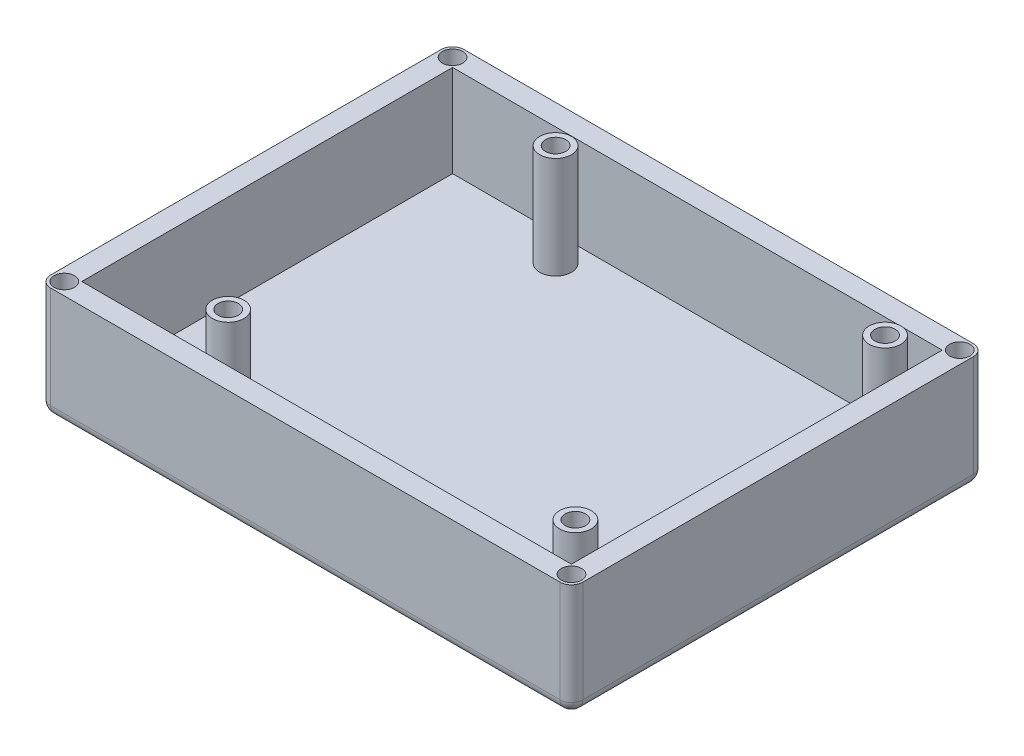
ISO-10303-21;
HEADER;
FILE_DESCRIPTION(('STEP AP214'),'2;1');
FILE_NAME('part.step','',(''),(''),'','','');
FILE_SCHEMA(('AUTOMOTIVE_DESIGN { 1 0 10303 214 1 1 1 1 }'));
ENDSEC;
DATA;
#1=APPLICATION_CONTEXT('core data for automotive mechanical design processes');
#2=APPLICATION_PROTOCOL_DEFINITION('international standard','automotive_design',2000,#1);
#3=PRODUCT_CONTEXT('',#1,'mechanical');
#4=PRODUCT('Part','Part','',(#3));
#5=PRODUCT_RELATED_PRODUCT_CATEGORY('part','',(#4));
#6=PRODUCT_DEFINITION_FORMATION('','',#4);
#7=PRODUCT_DEFINITION_CONTEXT('part definition',#1,'design');
#8=PRODUCT_DEFINITION('design','',#6,#7);
#9=PRODUCT_DEFINITION_SHAPE('','',#8);
#10=(LENGTH_UNIT() NAMED_UNIT(*) SI_UNIT(.MILLI.,.METRE.));
#11=(NAMED_UNIT(*) PLANE_ANGLE_UNIT() SI_UNIT($,.RADIAN.));
#12=(NAMED_UNIT(*) SI_UNIT($,.STERADIAN.) SOLID_ANGLE_UNIT());
#13=UNCERTAINTY_MEASURE_WITH_UNIT(LENGTH_MEASURE(1.E-05),#10,'distance_accuracy_value','');
#14=(GEOMETRIC_REPRESENTATION_CONTEXT(3) GLOBAL_UNCERTAINTY_ASSIGNED_CONTEXT((#13)) GLOBAL_UNIT_ASSIGNED_CONTEXT((#10,
#11,#12)) REPRESENTATION_CONTEXT('',''));
#15=CARTESIAN_POINT('',(0.,0.,0.));
#16=DIRECTION('',(0.,0.,1.));
#17=DIRECTION('',(1.,0.,0.));
#18=AXIS2_PLACEMENT_3D('',#15,#16,#17);
#19=CARTESIAN_POINT('',(-59.69,25.4,46.355));
#20=DIRECTION('',(1.,0.,0.));
#21=DIRECTION('',(0.,0.,-1.));
#22=AXIS2_PLACEMENT_3D('',#19,#20,#21);
#23=PLANE('',#22);
#24=DIRECTION('',(0.,-1.,0.));
#25=VECTOR('',#24,1.);
#26=CARTESIAN_POINT('',(-59.69,25.4,-43.815));
#27=LINE('',#26,#25);
#28=CARTESIAN_POINT('',(-59.69,25.4,-43.815));
#29=VERTEX_POINT('',#28);
#30=CARTESIAN_POINT('',(-59.69,2.54,-43.815));
#31=VERTEX_POINT('',#30);
#32=EDGE_CURVE('E239',#29,#31,#27,.T.);
#33=ORIENTED_EDGE('',*,*,#32,.T.);
#34=DIRECTION('',(0.,0.,-1.));
#35=VECTOR('',#34,1.);
#36=CARTESIAN_POINT('',(-59.69,2.54,46.355));
#37=LINE('',#36,#35);
#38=CARTESIAN_POINT('',(-59.69,2.54,43.815));
#39=VERTEX_POINT('',#38);
#40=EDGE_CURVE('E282',#31,#39,#37,.F.);
#41=ORIENTED_EDGE('',*,*,#40,.T.);
#42=DIRECTION('',(0.,-1.,0.));
#43=VECTOR('',#42,1.);
#44=CARTESIAN_POINT('',(-59.69,25.4,43.815));
#45=LINE('',#44,#43);
#46=CARTESIAN_POINT('',(-59.69,25.4,43.815));
#47=VERTEX_POINT('',#46);
#48=EDGE_CURVE('E236',#39,#47,#45,.F.);
#49=ORIENTED_EDGE('',*,*,#48,.T.);
#50=DIRECTION('',(0.,0.,-1.));
#51=VECTOR('',#50,1.);
#52=CARTESIAN_POINT('',(-59.69,25.4,46.355));
#53=LINE('',#52,#51);
#54=EDGE_CURVE('E200',#47,#29,#53,.T.);
#55=ORIENTED_EDGE('',*,*,#54,.T.);
#56=EDGE_LOOP('',(#33,#41,#49,#55));
#57=FACE_BOUND('',#56,.T.);
#58=ADVANCED_FACE('F45',(#57),#23,.F.);
#59=CARTESIAN_POINT('',(-59.69,0.,46.355));
#60=DIRECTION('',(0.,1.,0.));
#61=DIRECTION('',(0.,0.,1.));
#62=AXIS2_PLACEMENT_3D('',#59,#60,#61);
#63=PLANE('',#62);
#64=DIRECTION('',(0.,0.,-1.));
#65=VECTOR('',#64,1.);
#66=CARTESIAN_POINT('',(57.15,0.,46.355));
#67=LINE('',#66,#65);
#68=CARTESIAN_POINT('',(57.15,0.,-43.815));
#69=VERTEX_POINT('',#68);
#70=CARTESIAN_POINT('',(57.15,0.,43.815));
#71=VERTEX_POINT('',#70);
#72=EDGE_CURVE('E262',#69,#71,#67,.F.);
#73=ORIENTED_EDGE('',*,*,#72,.T.);
#74=DIRECTION('',(1.,0.,0.));
#75=VECTOR('',#74,1.);
#76=CARTESIAN_POINT('',(-57.15,0.,43.815));
#77=LINE('',#76,#75);
#78=CARTESIAN_POINT('',(-57.15,0.,43.815));
#79=VERTEX_POINT('',#78);
#80=EDGE_CURVE('E265',#71,#79,#77,.F.);
#81=ORIENTED_EDGE('',*,*,#80,.T.);
#82=DIRECTION('',(0.,0.,-1.));
#83=VECTOR('',#82,1.);
#84=CARTESIAN_POINT('',(-57.15,0.,46.355));
#85=LINE('',#84,#83);
#86=CARTESIAN_POINT('',(-57.15,0.,-43.815));
#87=VERTEX_POINT('',#86);
#88=EDGE_CURVE('E256',#79,#87,#85,.T.);
#89=ORIENTED_EDGE('',*,*,#88,.T.);
#90=DIRECTION('',(1.,0.,0.));
#91=VECTOR('',#90,1.);
#92=CARTESIAN_POINT('',(-59.69,0.,-43.815));
#93=LINE('',#92,#91);
#94=EDGE_CURVE('E259',#87,#69,#93,.T.);
#95=ORIENTED_EDGE('',*,*,#94,.T.);
#96=EDGE_LOOP('',(#73,#81,#89,#95));
#97=FACE_BOUND('',#96,.T.);
#98=ADVANCED_FACE('F357',(#97),#63,.F.);
#99=CARTESIAN_POINT('',(59.69,25.4,46.355));
#100=DIRECTION('',(-1.,0.,0.));
#101=DIRECTION('',(0.,-1.,0.));
#102=AXIS2_PLACEMENT_3D('',#99,#100,#101);
#103=PLANE('',#102);
#104=DIRECTION('',(0.,1.,0.));
#105=VECTOR('',#104,1.);
#106=CARTESIAN_POINT('',(59.69,0.,43.815));
#107=LINE('',#106,#105);
#108=CARTESIAN_POINT('',(59.69,25.4,43.815));
#109=VERTEX_POINT('',#108);
#110=CARTESIAN_POINT('',(59.69,2.54,43.815));
#111=VERTEX_POINT('',#110);
#112=EDGE_CURVE('E211',#109,#111,#107,.F.);
#113=ORIENTED_EDGE('',*,*,#112,.T.);
#114=DIRECTION('',(0.,0.,-1.));
#115=VECTOR('',#114,1.);
#116=CARTESIAN_POINT('',(59.69,2.54,46.355));
#117=LINE('',#116,#115);
#118=CARTESIAN_POINT('',(59.69,2.54,-43.815));
#119=VERTEX_POINT('',#118);
#120=EDGE_CURVE('E272',#111,#119,#117,.T.);
#121=ORIENTED_EDGE('',*,*,#120,.T.);
#122=DIRECTION('',(0.,1.,0.));
#123=VECTOR('',#122,1.);
#124=CARTESIAN_POINT('',(59.69,25.4,-43.815));
#125=LINE('',#124,#123);
#126=CARTESIAN_POINT('',(59.69,25.4,-43.815));
#127=VERTEX_POINT('',#126);
#128=EDGE_CURVE('E215',#119,#127,#125,.T.);
#129=ORIENTED_EDGE('',*,*,#128,.T.);
#130=DIRECTION('',(0.,0.,-1.));
#131=VECTOR('',#130,1.);
#132=CARTESIAN_POINT('',(59.69,25.4,46.355));
#133=LINE('',#132,#131);
#134=EDGE_CURVE('E207',#109,#127,#133,.T.);
#135=ORIENTED_EDGE('',*,*,#134,.F.);
#136=EDGE_LOOP('',(#113,#121,#129,#135));
#137=FACE_BOUND('',#136,.T.);
#138=ADVANCED_FACE('F363',(#137),#103,.F.);
#139=CARTESIAN_POINT('',(-59.69,25.4,46.355));
#140=DIRECTION('',(0.,-1.,0.));
#141=DIRECTION('',(1.,0.,0.));
#142=AXIS2_PLACEMENT_3D('',#139,#140,#141);
#143=PLANE('',#142);
#144=CARTESIAN_POINT('',(-56.896,25.4,-43.561));
#145=DIRECTION('',(0.,1.,0.));
#146=DIRECTION('',(-1.,0.,0.));
#147=AXIS2_PLACEMENT_3D('',#144,#145,#146);
#148=CIRCLE('',#147,2.28599999999999);
#149=CARTESIAN_POINT('',(-59.182,25.4,-43.561));
#150=VERTEX_POINT('',#149);
#151=EDGE_CURVE('E511',#150,#150,#148,.T.);
#152=ORIENTED_EDGE('',*,*,#151,.F.);
#153=EDGE_LOOP('',(#152));
#154=FACE_BOUND('',#153,.T.);
#155=CARTESIAN_POINT('',(56.896,25.4,43.561));
#156=DIRECTION('',(0.,1.,0.));
#157=DIRECTION('',(-1.,0.,0.));
#158=AXIS2_PLACEMENT_3D('',#155,#156,#157);
#159=CIRCLE('',#158,2.28599999999999);
#160=CARTESIAN_POINT('',(54.61,25.4,43.561));
#161=VERTEX_POINT('',#160);
#162=EDGE_CURVE('E503',#161,#161,#159,.T.);
#163=ORIENTED_EDGE('',*,*,#162,.F.);
#164=EDGE_LOOP('',(#163));
#165=FACE_BOUND('',#164,.T.);
#166=CARTESIAN_POINT('',(-56.896,25.4,43.561));
#167=DIRECTION('',(0.,1.,0.));
#168=DIRECTION('',(-1.,0.,0.));
#169=AXIS2_PLACEMENT_3D('',#166,#167,#168);
#170=CIRCLE('',#169,2.28599999999999);
#171=CARTESIAN_POINT('',(-59.182,25.4,43.561));
#172=VERTEX_POINT('',#171);
#173=EDGE_CURVE('E495',#172,#172,#170,.T.);
#174=ORIENTED_EDGE('',*,*,#173,.F.);
#175=EDGE_LOOP('',(#174));
#176=FACE_BOUND('',#175,.T.);
#177=CARTESIAN_POINT('',(56.896,25.4,-43.561));
#178=DIRECTION('',(0.,1.,0.));
#179=DIRECTION('',(-1.,0.,0.));
#180=AXIS2_PLACEMENT_3D('',#177,#178,#179);
#181=CIRCLE('',#180,2.286);
#182=CARTESIAN_POINT('',(54.61,25.4,-43.561));
#183=VERTEX_POINT('',#182);
#184=EDGE_CURVE('E482',#183,#183,#181,.T.);
#185=ORIENTED_EDGE('',*,*,#184,.F.);
#186=EDGE_LOOP('',(#185));
#187=FACE_BOUND('',#186,.T.);
#188=DIRECTION('',(-1.,0.,0.));
#189=VECTOR('',#188,1.);
#190=CARTESIAN_POINT('',(-54.9275,25.4,-41.5925));
#191=LINE('',#190,#189);
#192=CARTESIAN_POINT('',(54.9275,25.4,-41.5925));
#193=VERTEX_POINT('',#192);
#194=CARTESIAN_POINT('',(-54.9275,25.4,-41.5925));
#195=VERTEX_POINT('',#194);
#196=EDGE_CURVE('E166',#193,#195,#191,.T.);
#197=ORIENTED_EDGE('',*,*,#196,.F.);
#198=DIRECTION('',(0.,0.,-1.));
#199=VECTOR('',#198,1.);
#200=CARTESIAN_POINT('',(54.9275,25.4,41.5925));
#201=LINE('',#200,#199);
#202=CARTESIAN_POINT('',(54.9275,25.4,41.5925));
#203=VERTEX_POINT('',#202);
#204=EDGE_CURVE('E172',#203,#193,#201,.T.);
#205=ORIENTED_EDGE('',*,*,#204,.F.);
#206=DIRECTION('',(1.,0.,0.));
#207=VECTOR('',#206,1.);
#208=CARTESIAN_POINT('',(-54.9275,25.4,41.5925));
#209=LINE('',#208,#207);
#210=CARTESIAN_POINT('',(-54.9275,25.4,41.5925));
#211=VERTEX_POINT('',#210);
#212=EDGE_CURVE('E177',#211,#203,#209,.T.);
#213=ORIENTED_EDGE('',*,*,#212,.F.);
#214=DIRECTION('',(0.,0.,1.));
#215=VECTOR('',#214,1.);
#216=CARTESIAN_POINT('',(-54.9275,25.4,41.5925));
#217=LINE('',#216,#215);
#218=EDGE_CURVE('E154',#195,#211,#217,.T.);
#219=ORIENTED_EDGE('',*,*,#218,.F.);
#220=EDGE_LOOP('',(#197,#205,#213,#219));
#221=FACE_BOUND('',#220,.T.);
#222=ORIENTED_EDGE('',*,*,#134,.T.);
#223=CARTESIAN_POINT('',(57.15,25.4,-43.815));
#224=DIRECTION('',(0.,-1.,0.));
#225=DIRECTION('',(1.,0.,0.));
#226=AXIS2_PLACEMENT_3D('',#223,#224,#225);
#227=CIRCLE('',#226,2.54);
#228=CARTESIAN_POINT('',(57.15,25.4,-46.355));
#229=VERTEX_POINT('',#228);
#230=EDGE_CURVE('E227',#127,#229,#227,.F.);
#231=ORIENTED_EDGE('',*,*,#230,.T.);
#232=DIRECTION('',(-1.,0.,0.));
#233=VECTOR('',#232,1.);
#234=CARTESIAN_POINT('',(-59.69,25.4,-46.355));
#235=LINE('',#234,#233);
#236=CARTESIAN_POINT('',(-57.15,25.4,-46.355));
#237=VERTEX_POINT('',#236);
#238=EDGE_CURVE('E194',#229,#237,#235,.T.);
#239=ORIENTED_EDGE('',*,*,#238,.T.);
#240=CARTESIAN_POINT('',(-57.15,25.4,-43.815));
#241=DIRECTION('',(0.,-1.,0.));
#242=DIRECTION('',(1.,0.,0.));
#243=AXIS2_PLACEMENT_3D('',#240,#241,#242);
#244=CIRCLE('',#243,2.54);
#245=EDGE_CURVE('E224',#237,#29,#244,.F.);
#246=ORIENTED_EDGE('',*,*,#245,.T.);
#247=ORIENTED_EDGE('',*,*,#54,.F.);
#248=CARTESIAN_POINT('',(-57.15,25.4,43.815));
#249=DIRECTION('',(0.,-1.,0.));
#250=DIRECTION('',(1.,0.,0.));
#251=AXIS2_PLACEMENT_3D('',#248,#249,#250);
#252=CIRCLE('',#251,2.54);
#253=CARTESIAN_POINT('',(-57.15,25.4,46.355));
#254=VERTEX_POINT('',#253);
#255=EDGE_CURVE('E221',#47,#254,#252,.F.);
#256=ORIENTED_EDGE('',*,*,#255,.T.);
#257=DIRECTION('',(-1.,0.,0.));
#258=VECTOR('',#257,1.);
#259=CARTESIAN_POINT('',(-59.69,25.4,46.355));
#260=LINE('',#259,#258);
#261=CARTESIAN_POINT('',(57.15,25.4,46.355));
#262=VERTEX_POINT('',#261);
#263=EDGE_CURVE('E196',#262,#254,#260,.T.);
#264=ORIENTED_EDGE('',*,*,#263,.F.);
#265=CARTESIAN_POINT('',(57.15,25.4,43.815));
#266=DIRECTION('',(0.,-1.,0.));
#267=DIRECTION('',(1.,0.,0.));
#268=AXIS2_PLACEMENT_3D('',#265,#266,#267);
#269=CIRCLE('',#268,2.54);
#270=EDGE_CURVE('E218',#262,#109,#269,.F.);
#271=ORIENTED_EDGE('',*,*,#270,.T.);
#272=EDGE_LOOP('',(#222,#231,#239,#246,#247,#256,#264,#271));
#273=FACE_BOUND('',#272,.T.);
#274=ADVANCED_FACE('F174',(#154,#165,#176,#187,#221,#273),#143,.F.);
#275=CARTESIAN_POINT('',(0.,0.,46.355));
#276=DIRECTION('',(0.,0.,1.));
#277=DIRECTION('',(1.,0.,0.));
#278=AXIS2_PLACEMENT_3D('',#275,#276,#277);
#279=PLANE('',#278);
#280=DIRECTION('',(0.,-1.,0.));
#281=VECTOR('',#280,1.);
#282=CARTESIAN_POINT('',(-57.15,0.,46.355));
#283=LINE('',#282,#281);
#284=CARTESIAN_POINT('',(-57.15,2.54,46.355));
#285=VERTEX_POINT('',#284);
#286=EDGE_CURVE('E245',#254,#285,#283,.T.);
#287=ORIENTED_EDGE('',*,*,#286,.T.);
#288=DIRECTION('',(1.,0.,0.));
#289=VECTOR('',#288,1.);
#290=CARTESIAN_POINT('',(57.15,2.54,46.355));
#291=LINE('',#290,#289);
#292=CARTESIAN_POINT('',(57.15,2.54,46.355));
#293=VERTEX_POINT('',#292);
#294=EDGE_CURVE('E253',#285,#293,#291,.T.);
#295=ORIENTED_EDGE('',*,*,#294,.T.);
#296=DIRECTION('',(0.,1.,0.));
#297=VECTOR('',#296,1.);
#298=CARTESIAN_POINT('',(57.15,25.4,46.355));
#299=LINE('',#298,#297);
#300=EDGE_CURVE('E242',#293,#262,#299,.T.);
#301=ORIENTED_EDGE('',*,*,#300,.T.);
#302=ORIENTED_EDGE('',*,*,#263,.T.);
#303=EDGE_LOOP('',(#287,#295,#301,#302));
#304=FACE_BOUND('',#303,.T.);
#305=ADVANCED_FACE('F442',(#304),#279,.T.);
#306=CARTESIAN_POINT('',(0.,0.,-46.355));
#307=DIRECTION('',(0.,0.,1.));
#308=DIRECTION('',(1.,0.,0.));
#309=AXIS2_PLACEMENT_3D('',#306,#307,#308);
#310=PLANE('',#309);
#311=DIRECTION('',(0.,1.,0.));
#312=VECTOR('',#311,1.);
#313=CARTESIAN_POINT('',(57.15,0.,-46.355));
#314=LINE('',#313,#312);
#315=CARTESIAN_POINT('',(57.15,2.54,-46.355));
#316=VERTEX_POINT('',#315);
#317=EDGE_CURVE('E233',#229,#316,#314,.F.);
#318=ORIENTED_EDGE('',*,*,#317,.T.);
#319=DIRECTION('',(1.,0.,0.));
#320=VECTOR('',#319,1.);
#321=CARTESIAN_POINT('',(0.,2.54,-46.355));
#322=LINE('',#321,#320);
#323=CARTESIAN_POINT('',(-57.15,2.54,-46.355));
#324=VERTEX_POINT('',#323);
#325=EDGE_CURVE('E69',#316,#324,#322,.F.);
#326=ORIENTED_EDGE('',*,*,#325,.T.);
#327=DIRECTION('',(0.,-1.,0.));
#328=VECTOR('',#327,1.);
#329=CARTESIAN_POINT('',(-57.15,0.,-46.355));
#330=LINE('',#329,#328);
#331=EDGE_CURVE('E230',#324,#237,#330,.F.);
#332=ORIENTED_EDGE('',*,*,#331,.T.);
#333=ORIENTED_EDGE('',*,*,#238,.F.);
#334=EDGE_LOOP('',(#318,#326,#332,#333));
#335=FACE_BOUND('',#334,.T.);
#336=ADVANCED_FACE('F424',(#335),#310,.F.);
#337=CARTESIAN_POINT('',(54.9275,-137.796463125873,41.5925));
#338=DIRECTION('',(1.,0.,0.));
#339=DIRECTION('',(0.,1.,0.));
#340=AXIS2_PLACEMENT_3D('',#337,#338,#339);
#341=PLANE('',#340);
#342=DIRECTION('',(0.,0.,1.));
#343=VECTOR('',#342,1.);
#344=CARTESIAN_POINT('',(54.9275,4.7625,41.5925));
#345=LINE('',#344,#343);
#346=CARTESIAN_POINT('',(54.9275,4.7625,-41.5925));
#347=VERTEX_POINT('',#346);
#348=CARTESIAN_POINT('',(54.9275,4.7625,41.5925));
#349=VERTEX_POINT('',#348);
#350=EDGE_CURVE('E195',#347,#349,#345,.T.);
#351=ORIENTED_EDGE('',*,*,#350,.T.);
#352=DIRECTION('',(0.,1.,0.));
#353=VECTOR('',#352,1.);
#354=CARTESIAN_POINT('',(54.9275,-137.796463125873,41.5925));
#355=LINE('',#354,#353);
#356=EDGE_CURVE('E184',#349,#203,#355,.T.);
#357=ORIENTED_EDGE('',*,*,#356,.T.);
#358=ORIENTED_EDGE('',*,*,#204,.T.);
#359=DIRECTION('',(0.,1.,0.));
#360=VECTOR('',#359,1.);
#361=CARTESIAN_POINT('',(54.9275,-137.796463125873,-41.5925));
#362=LINE('',#361,#360);
#363=EDGE_CURVE('E162',#347,#193,#362,.T.);
#364=ORIENTED_EDGE('',*,*,#363,.F.);
#365=EDGE_LOOP('',(#351,#357,#358,#364));
#366=FACE_BOUND('',#365,.T.);
#367=ADVANCED_FACE('F458',(#366),#341,.F.);
#368=CARTESIAN_POINT('',(-54.9275,-137.796463125873,41.5925));
#369=DIRECTION('',(0.,0.,1.));
#370=DIRECTION('',(1.,0.,0.));
#371=AXIS2_PLACEMENT_3D('',#368,#369,#370);
#372=PLANE('',#371);
#373=DIRECTION('',(-1.,0.,0.));
#374=VECTOR('',#373,1.);
#375=CARTESIAN_POINT('',(-54.9275,4.7625,41.5925));
#376=LINE('',#375,#374);
#377=CARTESIAN_POINT('',(-54.9275,4.7625,41.5925));
#378=VERTEX_POINT('',#377);
#379=EDGE_CURVE('E474',#349,#378,#376,.T.);
#380=ORIENTED_EDGE('',*,*,#379,.T.);
#381=DIRECTION('',(0.,1.,0.));
#382=VECTOR('',#381,1.);
#383=CARTESIAN_POINT('',(-54.9275,-137.796463125873,41.5925));
#384=LINE('',#383,#382);
#385=EDGE_CURVE('E161',#378,#211,#384,.T.);
#386=ORIENTED_EDGE('',*,*,#385,.T.);
#387=ORIENTED_EDGE('',*,*,#212,.T.);
#388=ORIENTED_EDGE('',*,*,#356,.F.);
#389=EDGE_LOOP('',(#380,#386,#387,#388));
#390=FACE_BOUND('',#389,.T.);
#391=ADVANCED_FACE('F463',(#390),#372,.F.);
#392=CARTESIAN_POINT('',(-54.9275,-137.796463125873,41.5925));
#393=DIRECTION('',(-1.,0.,0.));
#394=DIRECTION('',(0.,-1.,0.));
#395=AXIS2_PLACEMENT_3D('',#392,#393,#394);
#396=PLANE('',#395);
#397=DIRECTION('',(0.,0.,-1.));
#398=VECTOR('',#397,1.);
#399=CARTESIAN_POINT('',(-54.9275,4.7625,41.5925));
#400=LINE('',#399,#398);
#401=CARTESIAN_POINT('',(-54.9275,4.7625,-41.5925));
#402=VERTEX_POINT('',#401);
#403=EDGE_CURVE('E157',#378,#402,#400,.T.);
#404=ORIENTED_EDGE('',*,*,#403,.T.);
#405=DIRECTION('',(0.,1.,0.));
#406=VECTOR('',#405,1.);
#407=CARTESIAN_POINT('',(-54.9275,-137.796463125873,-41.5925));
#408=LINE('',#407,#406);
#409=EDGE_CURVE('E149',#402,#195,#408,.T.);
#410=ORIENTED_EDGE('',*,*,#409,.T.);
#411=ORIENTED_EDGE('',*,*,#218,.T.);
#412=ORIENTED_EDGE('',*,*,#385,.F.);
#413=EDGE_LOOP('',(#404,#410,#411,#412));
#414=FACE_BOUND('',#413,.T.);
#415=ADVANCED_FACE('F151',(#414),#396,.F.);
#416=CARTESIAN_POINT('',(-54.9275,-137.796463125873,-41.5925));
#417=DIRECTION('',(0.,0.,-1.));
#418=DIRECTION('',(-1.,0.,0.));
#419=AXIS2_PLACEMENT_3D('',#416,#417,#418);
#420=PLANE('',#419);
#421=DIRECTION('',(1.,0.,0.));
#422=VECTOR('',#421,1.);
#423=CARTESIAN_POINT('',(-54.9275,4.7625,-41.5925));
#424=LINE('',#423,#422);
#425=EDGE_CURVE('E191',#402,#347,#424,.T.);
#426=ORIENTED_EDGE('',*,*,#425,.T.);
#427=ORIENTED_EDGE('',*,*,#363,.T.);
#428=ORIENTED_EDGE('',*,*,#196,.T.);
#429=ORIENTED_EDGE('',*,*,#409,.F.);
#430=EDGE_LOOP('',(#426,#427,#428,#429));
#431=FACE_BOUND('',#430,.T.);
#432=ADVANCED_FACE('F167',(#431),#420,.F.);
#433=CARTESIAN_POINT('',(-59.69,4.7625,46.355));
#434=DIRECTION('',(0.,1.,0.));
#435=DIRECTION('',(0.,0.,1.));
#436=AXIS2_PLACEMENT_3D('',#433,#434,#435);
#437=PLANE('',#436);
#438=CARTESIAN_POINT('',(48.9585,4.7625,34.7345));
#439=DIRECTION('',(0.,1.,0.));
#440=DIRECTION('',(0.,0.,1.));
#441=AXIS2_PLACEMENT_3D('',#438,#439,#440);
#442=CIRCLE('',#441,3.55600000000001);
#443=CARTESIAN_POINT('',(48.9585,4.7625,38.2905));
#444=VERTEX_POINT('',#443);
#445=EDGE_CURVE('E555',#444,#444,#442,.T.);
#446=ORIENTED_EDGE('',*,*,#445,.F.);
#447=EDGE_LOOP('',(#446));
#448=FACE_BOUND('',#447,.T.);
#449=CARTESIAN_POINT('',(47.8155,4.7625,-35.8775));
#450=DIRECTION('',(0.,1.,0.));
#451=DIRECTION('',(0.,0.,1.));
#452=AXIS2_PLACEMENT_3D('',#449,#450,#451);
#453=CIRCLE('',#452,3.55600000000001);
#454=CARTESIAN_POINT('',(47.8155,4.7625,-32.3215));
#455=VERTEX_POINT('',#454);
#456=EDGE_CURVE('E543',#455,#455,#453,.T.);
#457=ORIENTED_EDGE('',*,*,#456,.F.);
#458=EDGE_LOOP('',(#457));
#459=FACE_BOUND('',#458,.T.);
#460=CARTESIAN_POINT('',(-30.8737,4.7625,32.8041));
#461=DIRECTION('',(0.,1.,0.));
#462=DIRECTION('',(0.,0.,1.));
#463=AXIS2_PLACEMENT_3D('',#460,#461,#462);
#464=CIRCLE('',#463,3.55600000000001);
#465=CARTESIAN_POINT('',(-30.8737,4.7625,36.3601));
#466=VERTEX_POINT('',#465);
#467=EDGE_CURVE('E531',#466,#466,#464,.T.);
#468=ORIENTED_EDGE('',*,*,#467,.F.);
#469=EDGE_LOOP('',(#468));
#470=FACE_BOUND('',#469,.T.);
#471=CARTESIAN_POINT('',(-25.9715,4.7625,-35.7505));
#472=DIRECTION('',(0.,1.,0.));
#473=DIRECTION('',(0.,0.,1.));
#474=AXIS2_PLACEMENT_3D('',#471,#472,#473);
#475=CIRCLE('',#474,3.55600000000001);
#476=CARTESIAN_POINT('',(-25.9715,4.7625,-32.1945));
#477=VERTEX_POINT('',#476);
#478=EDGE_CURVE('E519',#477,#477,#475,.T.);
#479=ORIENTED_EDGE('',*,*,#478,.F.);
#480=EDGE_LOOP('',(#479));
#481=FACE_BOUND('',#480,.T.);
#482=ORIENTED_EDGE('',*,*,#350,.F.);
#483=ORIENTED_EDGE('',*,*,#425,.F.);
#484=ORIENTED_EDGE('',*,*,#403,.F.);
#485=ORIENTED_EDGE('',*,*,#379,.F.);
#486=EDGE_LOOP('',(#482,#483,#484,#485));
#487=FACE_BOUND('',#486,.T.);
#488=ADVANCED_FACE('F345',(#448,#459,#470,#481,#487),#437,.T.);
#489=CARTESIAN_POINT('',(57.15,25.4,-43.815));
#490=DIRECTION('',(0.,1.,0.));
#491=DIRECTION('',(-1.,0.,0.));
#492=AXIS2_PLACEMENT_3D('',#489,#490,#491);
#493=CYLINDRICAL_SURFACE('',#492,2.54);
#494=ORIENTED_EDGE('',*,*,#128,.F.);
#495=CARTESIAN_POINT('',(57.15,2.54,-43.815));
#496=DIRECTION('',(0.,1.,0.));
#497=DIRECTION('',(-1.,0.,0.));
#498=AXIS2_PLACEMENT_3D('',#495,#496,#497);
#499=CIRCLE('',#498,2.54);
#500=EDGE_CURVE('E275',#119,#316,#499,.T.);
#501=ORIENTED_EDGE('',*,*,#500,.T.);
#502=ORIENTED_EDGE('',*,*,#317,.F.);
#503=ORIENTED_EDGE('',*,*,#230,.F.);
#504=EDGE_LOOP('',(#494,#501,#502,#503));
#505=FACE_BOUND('',#504,.T.);
#506=ADVANCED_FACE('F368',(#505),#493,.T.);
#507=CARTESIAN_POINT('',(-57.15,25.4,-43.815));
#508=DIRECTION('',(0.,-1.,0.));
#509=DIRECTION('',(0.,0.,-1.));
#510=AXIS2_PLACEMENT_3D('',#507,#508,#509);
#511=CYLINDRICAL_SURFACE('',#510,2.54);
#512=ORIENTED_EDGE('',*,*,#331,.F.);
#513=CARTESIAN_POINT('',(-57.15,2.54,-43.815));
#514=DIRECTION('',(0.,-1.,0.));
#515=DIRECTION('',(0.,0.,-1.));
#516=AXIS2_PLACEMENT_3D('',#513,#514,#515);
#517=CIRCLE('',#516,2.54);
#518=EDGE_CURVE('E61',#324,#31,#517,.F.);
#519=ORIENTED_EDGE('',*,*,#518,.T.);
#520=ORIENTED_EDGE('',*,*,#32,.F.);
#521=ORIENTED_EDGE('',*,*,#245,.F.);
#522=EDGE_LOOP('',(#512,#519,#520,#521));
#523=FACE_BOUND('',#522,.T.);
#524=ADVANCED_FACE('F371',(#523),#511,.T.);
#525=CARTESIAN_POINT('',(-57.15,0.,43.815));
#526=DIRECTION('',(0.,1.,0.));
#527=DIRECTION('',(0.,0.,1.));
#528=AXIS2_PLACEMENT_3D('',#525,#526,#527);
#529=CYLINDRICAL_SURFACE('',#528,2.54);
#530=ORIENTED_EDGE('',*,*,#48,.F.);
#531=CARTESIAN_POINT('',(-57.15,2.54,43.815));
#532=DIRECTION('',(0.,1.,0.));
#533=DIRECTION('',(0.,0.,1.));
#534=AXIS2_PLACEMENT_3D('',#531,#532,#533);
#535=CIRCLE('',#534,2.54);
#536=EDGE_CURVE('E249',#39,#285,#535,.T.);
#537=ORIENTED_EDGE('',*,*,#536,.T.);
#538=ORIENTED_EDGE('',*,*,#286,.F.);
#539=ORIENTED_EDGE('',*,*,#255,.F.);
#540=EDGE_LOOP('',(#530,#537,#538,#539));
#541=FACE_BOUND('',#540,.T.);
#542=ADVANCED_FACE('F375',(#541),#529,.T.);
#543=CARTESIAN_POINT('',(57.15,0.,43.815));
#544=DIRECTION('',(0.,-1.,0.));
#545=DIRECTION('',(1.,0.,0.));
#546=AXIS2_PLACEMENT_3D('',#543,#544,#545);
#547=CYLINDRICAL_SURFACE('',#546,2.54);
#548=ORIENTED_EDGE('',*,*,#300,.F.);
#549=CARTESIAN_POINT('',(57.15,2.54,43.815));
#550=DIRECTION('',(0.,-1.,0.));
#551=DIRECTION('',(1.,0.,0.));
#552=AXIS2_PLACEMENT_3D('',#549,#550,#551);
#553=CIRCLE('',#552,2.54);
#554=EDGE_CURVE('E269',#293,#111,#553,.F.);
#555=ORIENTED_EDGE('',*,*,#554,.T.);
#556=ORIENTED_EDGE('',*,*,#112,.F.);
#557=ORIENTED_EDGE('',*,*,#270,.F.);
#558=EDGE_LOOP('',(#548,#555,#556,#557));
#559=FACE_BOUND('',#558,.T.);
#560=ADVANCED_FACE('F378',(#559),#547,.T.);
#561=CARTESIAN_POINT('',(57.15,2.54,-43.815));
#562=DIRECTION('',(0.,1.,0.));
#563=DIRECTION('',(0.,0.,1.));
#564=AXIS2_PLACEMENT_3D('',#561,#562,#563);
#565=SPHERICAL_SURFACE('',#564,2.54);
#566=CARTESIAN_POINT('',(57.15,2.54,-43.815));
#567=DIRECTION('',(-1.,0.,0.));
#568=DIRECTION('',(0.,0.,1.));
#569=AXIS2_PLACEMENT_3D('',#566,#567,#568);
#570=CIRCLE('',#569,2.54);
#571=EDGE_CURVE('E309',#316,#69,#570,.T.);
#572=ORIENTED_EDGE('',*,*,#571,.F.);
#573=ORIENTED_EDGE('',*,*,#500,.F.);
#574=CARTESIAN_POINT('',(57.15,2.54,-43.815));
#575=DIRECTION('',(0.,0.,1.));
#576=DIRECTION('',(1.,0.,0.));
#577=AXIS2_PLACEMENT_3D('',#574,#575,#576);
#578=CIRCLE('',#577,2.54);
#579=EDGE_CURVE('E313',#69,#119,#578,.T.);
#580=ORIENTED_EDGE('',*,*,#579,.F.);
#581=EDGE_LOOP('',(#572,#573,#580));
#582=FACE_BOUND('',#581,.T.);
#583=ADVANCED_FACE('F47',(#582),#565,.T.);
#584=CARTESIAN_POINT('',(57.15,2.54,46.355));
#585=DIRECTION('',(0.,0.,-1.));
#586=DIRECTION('',(-1.,0.,0.));
#587=AXIS2_PLACEMENT_3D('',#584,#585,#586);
#588=CYLINDRICAL_SURFACE('',#587,2.54);
#589=ORIENTED_EDGE('',*,*,#579,.T.);
#590=ORIENTED_EDGE('',*,*,#120,.F.);
#591=CARTESIAN_POINT('',(57.15,2.54,43.815));
#592=DIRECTION('',(0.,0.,1.));
#593=DIRECTION('',(1.,0.,0.));
#594=AXIS2_PLACEMENT_3D('',#591,#592,#593);
#595=CIRCLE('',#594,2.54);
#596=EDGE_CURVE('E305',#71,#111,#595,.T.);
#597=ORIENTED_EDGE('',*,*,#596,.F.);
#598=ORIENTED_EDGE('',*,*,#72,.F.);
#599=EDGE_LOOP('',(#589,#590,#597,#598));
#600=FACE_BOUND('',#599,.T.);
#601=ADVANCED_FACE('F406',(#600),#588,.T.);
#602=CARTESIAN_POINT('',(-59.69,2.54,-43.815));
#603=DIRECTION('',(1.,0.,0.));
#604=DIRECTION('',(0.,0.,-1.));
#605=AXIS2_PLACEMENT_3D('',#602,#603,#604);
#606=CYLINDRICAL_SURFACE('',#605,2.54);
#607=ORIENTED_EDGE('',*,*,#571,.T.);
#608=ORIENTED_EDGE('',*,*,#94,.F.);
#609=CARTESIAN_POINT('',(-57.15,2.54,-43.815));
#610=DIRECTION('',(-1.,0.,0.));
#611=DIRECTION('',(0.,0.,1.));
#612=AXIS2_PLACEMENT_3D('',#609,#610,#611);
#613=CIRCLE('',#612,2.54);
#614=EDGE_CURVE('E301',#324,#87,#613,.T.);
#615=ORIENTED_EDGE('',*,*,#614,.F.);
#616=ORIENTED_EDGE('',*,*,#325,.F.);
#617=EDGE_LOOP('',(#607,#608,#615,#616));
#618=FACE_BOUND('',#617,.T.);
#619=ADVANCED_FACE('F403',(#618),#606,.T.);
#620=CARTESIAN_POINT('',(57.15,2.54,43.815));
#621=DIRECTION('',(0.,1.,0.));
#622=DIRECTION('',(0.,0.,1.));
#623=AXIS2_PLACEMENT_3D('',#620,#621,#622);
#624=SPHERICAL_SURFACE('',#623,2.54);
#625=ORIENTED_EDGE('',*,*,#596,.T.);
#626=ORIENTED_EDGE('',*,*,#554,.F.);
#627=CARTESIAN_POINT('',(57.15,2.54,43.815));
#628=DIRECTION('',(-1.,0.,0.));
#629=DIRECTION('',(0.,0.,1.));
#630=AXIS2_PLACEMENT_3D('',#627,#628,#629);
#631=CIRCLE('',#630,2.54);
#632=EDGE_CURVE('E297',#71,#293,#631,.T.);
#633=ORIENTED_EDGE('',*,*,#632,.F.);
#634=EDGE_LOOP('',(#625,#626,#633));
#635=FACE_BOUND('',#634,.T.);
#636=ADVANCED_FACE('F399',(#635),#624,.T.);
#637=CARTESIAN_POINT('',(-57.15,2.54,-43.815));
#638=DIRECTION('',(0.,1.,0.));
#639=DIRECTION('',(0.,0.,1.));
#640=AXIS2_PLACEMENT_3D('',#637,#638,#639);
#641=SPHERICAL_SURFACE('',#640,2.54);
#642=ORIENTED_EDGE('',*,*,#518,.F.);
#643=ORIENTED_EDGE('',*,*,#614,.T.);
#644=CARTESIAN_POINT('',(-57.15,2.54,-43.815));
#645=DIRECTION('',(0.,0.,1.));
#646=DIRECTION('',(1.,0.,0.));
#647=AXIS2_PLACEMENT_3D('',#644,#645,#646);
#648=CIRCLE('',#647,2.54);
#649=EDGE_CURVE('E293',#31,#87,#648,.T.);
#650=ORIENTED_EDGE('',*,*,#649,.F.);
#651=EDGE_LOOP('',(#642,#643,#650));
#652=FACE_BOUND('',#651,.T.);
#653=ADVANCED_FACE('F395',(#652),#641,.T.);
#654=CARTESIAN_POINT('',(0.,2.54,43.815));
#655=DIRECTION('',(-1.,0.,0.));
#656=DIRECTION('',(0.,0.,1.));
#657=AXIS2_PLACEMENT_3D('',#654,#655,#656);
#658=CYLINDRICAL_SURFACE('',#657,2.54);
#659=ORIENTED_EDGE('',*,*,#632,.T.);
#660=ORIENTED_EDGE('',*,*,#294,.F.);
#661=CARTESIAN_POINT('',(-57.15,2.54,43.815));
#662=DIRECTION('',(-1.,0.,0.));
#663=DIRECTION('',(0.,0.,1.));
#664=AXIS2_PLACEMENT_3D('',#661,#662,#663);
#665=CIRCLE('',#664,2.54);
#666=EDGE_CURVE('E289',#79,#285,#665,.T.);
#667=ORIENTED_EDGE('',*,*,#666,.F.);
#668=ORIENTED_EDGE('',*,*,#80,.F.);
#669=EDGE_LOOP('',(#659,#660,#667,#668));
#670=FACE_BOUND('',#669,.T.);
#671=ADVANCED_FACE('F391',(#670),#658,.T.);
#672=CARTESIAN_POINT('',(-57.15,2.54,46.355));
#673=DIRECTION('',(0.,0.,-1.));
#674=DIRECTION('',(-1.,0.,0.));
#675=AXIS2_PLACEMENT_3D('',#672,#673,#674);
#676=CYLINDRICAL_SURFACE('',#675,2.54);
#677=ORIENTED_EDGE('',*,*,#649,.T.);
#678=ORIENTED_EDGE('',*,*,#88,.F.);
#679=CARTESIAN_POINT('',(-57.15,2.54,43.815));
#680=DIRECTION('',(0.,0.,1.));
#681=DIRECTION('',(1.,0.,0.));
#682=AXIS2_PLACEMENT_3D('',#679,#680,#681);
#683=CIRCLE('',#682,2.54);
#684=EDGE_CURVE('E286',#39,#79,#683,.T.);
#685=ORIENTED_EDGE('',*,*,#684,.F.);
#686=ORIENTED_EDGE('',*,*,#40,.F.);
#687=EDGE_LOOP('',(#677,#678,#685,#686));
#688=FACE_BOUND('',#687,.T.);
#689=ADVANCED_FACE('F387',(#688),#676,.T.);
#690=CARTESIAN_POINT('',(-57.15,2.54,43.815));
#691=DIRECTION('',(0.,1.,0.));
#692=DIRECTION('',(0.,0.,1.));
#693=AXIS2_PLACEMENT_3D('',#690,#691,#692);
#694=SPHERICAL_SURFACE('',#693,2.54);
#695=ORIENTED_EDGE('',*,*,#666,.T.);
#696=ORIENTED_EDGE('',*,*,#536,.F.);
#697=ORIENTED_EDGE('',*,*,#684,.T.);
#698=EDGE_LOOP('',(#695,#696,#697));
#699=FACE_BOUND('',#698,.T.);
#700=ADVANCED_FACE('F383',(#699),#694,.T.);
#701=CARTESIAN_POINT('',(56.896,5.08,-43.561));
#702=DIRECTION('',(0.,1.,0.));
#703=DIRECTION('',(-1.,0.,0.));
#704=AXIS2_PLACEMENT_3D('',#701,#702,#703);
#705=CYLINDRICAL_SURFACE('',#704,2.286);
#706=CARTESIAN_POINT('',(56.896,5.08,-43.561));
#707=DIRECTION('',(0.,1.,0.));
#708=DIRECTION('',(-1.,0.,0.));
#709=AXIS2_PLACEMENT_3D('',#706,#707,#708);
#710=CIRCLE('',#709,2.286);
#711=CARTESIAN_POINT('',(54.61,5.08,-43.561));
#712=VERTEX_POINT('',#711);
#713=EDGE_CURVE('E290',#712,#712,#710,.T.);
#714=ORIENTED_EDGE('',*,*,#713,.F.);
#715=EDGE_LOOP('',(#714));
#716=FACE_BOUND('',#715,.T.);
#717=ORIENTED_EDGE('',*,*,#184,.T.);
#718=EDGE_LOOP('',(#717));
#719=FACE_BOUND('',#718,.T.);
#720=ADVANCED_FACE('F386',(#716,#719),#705,.F.);
#721=CARTESIAN_POINT('',(56.896,5.08,-43.561));
#722=DIRECTION('',(0.,1.,0.));
#723=DIRECTION('',(-1.,0.,0.));
#724=AXIS2_PLACEMENT_3D('',#721,#722,#723);
#725=PLANE('',#724);
#726=ORIENTED_EDGE('',*,*,#713,.T.);
#727=EDGE_LOOP('',(#726));
#728=FACE_BOUND('',#727,.T.);
#729=ADVANCED_FACE('F628',(#728),#725,.T.);
#730=CARTESIAN_POINT('',(-56.896,5.08,43.561));
#731=DIRECTION('',(0.,1.,0.));
#732=DIRECTION('',(-1.,0.,0.));
#733=AXIS2_PLACEMENT_3D('',#730,#731,#732);
#734=CYLINDRICAL_SURFACE('',#733,2.28599999999999);
#735=CARTESIAN_POINT('',(-56.896,5.08,43.561));
#736=DIRECTION('',(0.,1.,0.));
#737=DIRECTION('',(-1.,0.,0.));
#738=AXIS2_PLACEMENT_3D('',#735,#736,#737);
#739=CIRCLE('',#738,2.28599999999999);
#740=CARTESIAN_POINT('',(-59.182,5.08,43.561));
#741=VERTEX_POINT('',#740);
#742=EDGE_CURVE('E492',#741,#741,#739,.T.);
#743=ORIENTED_EDGE('',*,*,#742,.F.);
#744=EDGE_LOOP('',(#743));
#745=FACE_BOUND('',#744,.T.);
#746=ORIENTED_EDGE('',*,*,#173,.T.);
#747=EDGE_LOOP('',(#746));
#748=FACE_BOUND('',#747,.T.);
#749=ADVANCED_FACE('F624',(#745,#748),#734,.F.);
#750=CARTESIAN_POINT('',(-56.896,5.08,43.561));
#751=DIRECTION('',(0.,1.,0.));
#752=DIRECTION('',(-1.,0.,0.));
#753=AXIS2_PLACEMENT_3D('',#750,#751,#752);
#754=PLANE('',#753);
#755=ORIENTED_EDGE('',*,*,#742,.T.);
#756=EDGE_LOOP('',(#755));
#757=FACE_BOUND('',#756,.T.);
#758=ADVANCED_FACE('F620',(#757),#754,.T.);
#759=CARTESIAN_POINT('',(56.896,5.08,43.561));
#760=DIRECTION('',(0.,1.,0.));
#761=DIRECTION('',(-1.,0.,0.));
#762=AXIS2_PLACEMENT_3D('',#759,#760,#761);
#763=CYLINDRICAL_SURFACE('',#762,2.28599999999999);
#764=CARTESIAN_POINT('',(56.896,5.08,43.561));
#765=DIRECTION('',(0.,1.,0.));
#766=DIRECTION('',(-1.,0.,0.));
#767=AXIS2_PLACEMENT_3D('',#764,#765,#766);
#768=CIRCLE('',#767,2.28599999999999);
#769=CARTESIAN_POINT('',(54.61,5.08,43.561));
#770=VERTEX_POINT('',#769);
#771=EDGE_CURVE('E499',#770,#770,#768,.T.);
#772=ORIENTED_EDGE('',*,*,#771,.F.);
#773=EDGE_LOOP('',(#772));
#774=FACE_BOUND('',#773,.T.);
#775=ORIENTED_EDGE('',*,*,#162,.T.);
#776=EDGE_LOOP('',(#775));
#777=FACE_BOUND('',#776,.T.);
#778=ADVANCED_FACE('F616',(#774,#777),#763,.F.);
#779=CARTESIAN_POINT('',(56.896,5.08,43.561));
#780=DIRECTION('',(0.,1.,0.));
#781=DIRECTION('',(-1.,0.,0.));
#782=AXIS2_PLACEMENT_3D('',#779,#780,#781);
#783=PLANE('',#782);
#784=ORIENTED_EDGE('',*,*,#771,.T.);
#785=EDGE_LOOP('',(#784));
#786=FACE_BOUND('',#785,.T.);
#787=ADVANCED_FACE('F612',(#786),#783,.T.);
#788=CARTESIAN_POINT('',(-56.896,5.08,-43.561));
#789=DIRECTION('',(0.,1.,0.));
#790=DIRECTION('',(-1.,0.,0.));
#791=AXIS2_PLACEMENT_3D('',#788,#789,#790);
#792=CYLINDRICAL_SURFACE('',#791,2.28599999999999);
#793=CARTESIAN_POINT('',(-56.896,5.08,-43.561));
#794=DIRECTION('',(0.,1.,0.));
#795=DIRECTION('',(-1.,0.,0.));
#796=AXIS2_PLACEMENT_3D('',#793,#794,#795);
#797=CIRCLE('',#796,2.28599999999999);
#798=CARTESIAN_POINT('',(-59.182,5.08,-43.561));
#799=VERTEX_POINT('',#798);
#800=EDGE_CURVE('E507',#799,#799,#797,.T.);
#801=ORIENTED_EDGE('',*,*,#800,.F.);
#802=EDGE_LOOP('',(#801));
#803=FACE_BOUND('',#802,.T.);
#804=ORIENTED_EDGE('',*,*,#151,.T.);
#805=EDGE_LOOP('',(#804));
#806=FACE_BOUND('',#805,.T.);
#807=ADVANCED_FACE('F608',(#803,#806),#792,.F.);
#808=CARTESIAN_POINT('',(-56.896,5.08,-43.561));
#809=DIRECTION('',(0.,1.,0.));
#810=DIRECTION('',(-1.,0.,0.));
#811=AXIS2_PLACEMENT_3D('',#808,#809,#810);
#812=PLANE('',#811);
#813=ORIENTED_EDGE('',*,*,#800,.T.);
#814=EDGE_LOOP('',(#813));
#815=FACE_BOUND('',#814,.T.);
#816=ADVANCED_FACE('F601',(#815),#812,.T.);
#817=CARTESIAN_POINT('',(-25.9715,27.6225,-35.7505));
#818=DIRECTION('',(0.,1.,0.));
#819=DIRECTION('',(0.,0.,1.));
#820=AXIS2_PLACEMENT_3D('',#817,#818,#819);
#821=PLANE('',#820);
#822=CARTESIAN_POINT('',(-25.9715,27.6225,-35.7505));
#823=DIRECTION('',(0.,1.,0.));
#824=DIRECTION('',(0.,0.,1.));
#825=AXIS2_PLACEMENT_3D('',#822,#823,#824);
#826=CIRCLE('',#825,3.55600000000001);
#827=CARTESIAN_POINT('',(-25.9715,27.6225,-32.1945));
#828=VERTEX_POINT('',#827);
#829=EDGE_CURVE('E515',#828,#828,#826,.T.);
#830=ORIENTED_EDGE('',*,*,#829,.T.);
#831=EDGE_LOOP('',(#830));
#832=FACE_BOUND('',#831,.T.);
#833=CARTESIAN_POINT('',(-25.9715,27.6225,-35.7505));
#834=DIRECTION('',(0.,1.,0.));
#835=DIRECTION('',(0.,0.,1.));
#836=AXIS2_PLACEMENT_3D('',#833,#834,#835);
#837=CIRCLE('',#836,2.286);
#838=CARTESIAN_POINT('',(-25.9715,27.6225,-33.4645));
#839=VERTEX_POINT('',#838);
#840=EDGE_CURVE('E523',#839,#839,#837,.T.);
#841=ORIENTED_EDGE('',*,*,#840,.F.);
#842=EDGE_LOOP('',(#841));
#843=FACE_BOUND('',#842,.T.);
#844=ADVANCED_FACE('F598',(#832,#843),#821,.T.);
#845=CARTESIAN_POINT('',(-25.9715,27.6225,-35.7505));
#846=DIRECTION('',(0.,-1.,0.));
#847=DIRECTION('',(0.,0.,-1.));
#848=AXIS2_PLACEMENT_3D('',#845,#846,#847);
#849=CYLINDRICAL_SURFACE('',#848,3.55600000000001);
#850=ORIENTED_EDGE('',*,*,#829,.F.);
#851=EDGE_LOOP('',(#850));
#852=FACE_BOUND('',#851,.T.);
#853=ORIENTED_EDGE('',*,*,#478,.T.);
#854=EDGE_LOOP('',(#853));
#855=FACE_BOUND('',#854,.T.);
#856=ADVANCED_FACE('F596',(#852,#855),#849,.T.);
#857=CARTESIAN_POINT('',(-25.9715,27.6225,-35.7505));
#858=DIRECTION('',(0.,-1.,0.));
#859=DIRECTION('',(0.,0.,-1.));
#860=AXIS2_PLACEMENT_3D('',#857,#858,#859);
#861=CYLINDRICAL_SURFACE('',#860,2.286);
#862=ORIENTED_EDGE('',*,*,#840,.T.);
#863=EDGE_LOOP('',(#862));
#864=FACE_BOUND('',#863,.T.);
#865=CARTESIAN_POINT('',(-25.9715,4.7625,-35.7505));
#866=DIRECTION('',(0.,1.,0.));
#867=DIRECTION('',(0.,0.,1.));
#868=AXIS2_PLACEMENT_3D('',#865,#866,#867);
#869=CIRCLE('',#868,2.286);
#870=CARTESIAN_POINT('',(-25.9715,4.7625,-33.4645));
#871=VERTEX_POINT('',#870);
#872=EDGE_CURVE('E285',#871,#871,#869,.F.);
#873=ORIENTED_EDGE('',*,*,#872,.T.);
#874=EDGE_LOOP('',(#873));
#875=FACE_BOUND('',#874,.T.);
#876=ADVANCED_FACE('F593',(#864,#875),#861,.F.);
#877=ORIENTED_EDGE('',*,*,#872,.F.);
#878=EDGE_LOOP('',(#877));
#879=FACE_BOUND('',#878,.T.);
#880=ADVANCED_FACE('F352',(#879),#437,.T.);
#881=CARTESIAN_POINT('',(-30.8737,27.6225,32.8041));
#882=DIRECTION('',(0.,1.,0.));
#883=DIRECTION('',(0.,0.,1.));
#884=AXIS2_PLACEMENT_3D('',#881,#882,#883);
#885=PLANE('',#884);
#886=CARTESIAN_POINT('',(-30.8737,27.6225,32.8041));
#887=DIRECTION('',(0.,1.,0.));
#888=DIRECTION('',(0.,0.,1.));
#889=AXIS2_PLACEMENT_3D('',#886,#887,#888);
#890=CIRCLE('',#889,3.55600000000001);
#891=CARTESIAN_POINT('',(-30.8737,27.6225,36.3601));
#892=VERTEX_POINT('',#891);
#893=EDGE_CURVE('E527',#892,#892,#890,.T.);
#894=ORIENTED_EDGE('',*,*,#893,.T.);
#895=EDGE_LOOP('',(#894));
#896=FACE_BOUND('',#895,.T.);
#897=CARTESIAN_POINT('',(-30.8737,27.6225,32.8041));
#898=DIRECTION('',(0.,1.,0.));
#899=DIRECTION('',(0.,0.,1.));
#900=AXIS2_PLACEMENT_3D('',#897,#898,#899);
#901=CIRCLE('',#900,2.286);
#902=CARTESIAN_POINT('',(-30.8737,27.6225,35.0901));
#903=VERTEX_POINT('',#902);
#904=EDGE_CURVE('E535',#903,#903,#901,.T.);
#905=ORIENTED_EDGE('',*,*,#904,.F.);
#906=EDGE_LOOP('',(#905));
#907=FACE_BOUND('',#906,.T.);
#908=ADVANCED_FACE('F586',(#896,#907),#885,.T.);
#909=CARTESIAN_POINT('',(-30.8737,27.6225,32.8041));
#910=DIRECTION('',(0.,-1.,0.));
#911=DIRECTION('',(0.,0.,-1.));
#912=AXIS2_PLACEMENT_3D('',#909,#910,#911);
#913=CYLINDRICAL_SURFACE('',#912,3.55600000000001);
#914=ORIENTED_EDGE('',*,*,#893,.F.);
#915=EDGE_LOOP('',(#914));
#916=FACE_BOUND('',#915,.T.);
#917=ORIENTED_EDGE('',*,*,#467,.T.);
#918=EDGE_LOOP('',(#917));
#919=FACE_BOUND('',#918,.T.);
#920=ADVANCED_FACE('F584',(#916,#919),#913,.T.);
#921=CARTESIAN_POINT('',(-30.8737,27.6225,32.8041));
#922=DIRECTION('',(0.,-1.,0.));
#923=DIRECTION('',(0.,0.,-1.));
#924=AXIS2_PLACEMENT_3D('',#921,#922,#923);
#925=CYLINDRICAL_SURFACE('',#924,2.286);
#926=ORIENTED_EDGE('',*,*,#904,.T.);
#927=EDGE_LOOP('',(#926));
#928=FACE_BOUND('',#927,.T.);
#929=CARTESIAN_POINT('',(-30.8737,4.7625,32.8041));
#930=DIRECTION('',(0.,1.,0.));
#931=DIRECTION('',(0.,0.,1.));
#932=AXIS2_PLACEMENT_3D('',#929,#930,#931);
#933=CIRCLE('',#932,2.286);
#934=CARTESIAN_POINT('',(-30.8737,4.7625,35.0901));
#935=VERTEX_POINT('',#934);
#936=EDGE_CURVE('E320',#935,#935,#933,.F.);
#937=ORIENTED_EDGE('',*,*,#936,.T.);
#938=EDGE_LOOP('',(#937));
#939=FACE_BOUND('',#938,.T.);
#940=ADVANCED_FACE('F350',(#928,#939),#925,.F.);
#941=ORIENTED_EDGE('',*,*,#936,.F.);
#942=EDGE_LOOP('',(#941));
#943=FACE_BOUND('',#942,.T.);
#944=ADVANCED_FACE('F333',(#943),#437,.T.);
#945=CARTESIAN_POINT('',(47.8155,27.6225,-35.8775));
#946=DIRECTION('',(0.,1.,0.));
#947=DIRECTION('',(0.,0.,1.));
#948=AXIS2_PLACEMENT_3D('',#945,#946,#947);
#949=PLANE('',#948);
#950=CARTESIAN_POINT('',(47.8155,27.6225,-35.8775));
#951=DIRECTION('',(0.,1.,0.));
#952=DIRECTION('',(0.,0.,1.));
#953=AXIS2_PLACEMENT_3D('',#950,#951,#952);
#954=CIRCLE('',#953,3.55600000000001);
#955=CARTESIAN_POINT('',(47.8155,27.6225,-32.3215));
#956=VERTEX_POINT('',#955);
#957=EDGE_CURVE('E539',#956,#956,#954,.T.);
#958=ORIENTED_EDGE('',*,*,#957,.T.);
#959=EDGE_LOOP('',(#958));
#960=FACE_BOUND('',#959,.T.);
#961=CARTESIAN_POINT('',(47.8155,27.6225,-35.8775));
#962=DIRECTION('',(0.,1.,0.));
#963=DIRECTION('',(0.,0.,1.));
#964=AXIS2_PLACEMENT_3D('',#961,#962,#963);
#965=CIRCLE('',#964,2.28599999999999);
#966=CARTESIAN_POINT('',(47.8155,27.6225,-33.5915));
#967=VERTEX_POINT('',#966);
#968=EDGE_CURVE('E547',#967,#967,#965,.T.);
#969=ORIENTED_EDGE('',*,*,#968,.F.);
#970=EDGE_LOOP('',(#969));
#971=FACE_BOUND('',#970,.T.);
#972=ADVANCED_FACE('F349',(#960,#971),#949,.T.);
#973=CARTESIAN_POINT('',(47.8155,27.6225,-35.8775));
#974=DIRECTION('',(0.,-1.,0.));
#975=DIRECTION('',(0.,0.,-1.));
#976=AXIS2_PLACEMENT_3D('',#973,#974,#975);
#977=CYLINDRICAL_SURFACE('',#976,3.55600000000001);
#978=ORIENTED_EDGE('',*,*,#957,.F.);
#979=EDGE_LOOP('',(#978));
#980=FACE_BOUND('',#979,.T.);
#981=ORIENTED_EDGE('',*,*,#456,.T.);
#982=EDGE_LOOP('',(#981));
#983=FACE_BOUND('',#982,.T.);
#984=ADVANCED_FACE('F342',(#980,#983),#977,.T.);
#985=CARTESIAN_POINT('',(47.8155,27.6225,-35.8775));
#986=DIRECTION('',(0.,-1.,0.));
#987=DIRECTION('',(0.,0.,-1.));
#988=AXIS2_PLACEMENT_3D('',#985,#986,#987);
#989=CYLINDRICAL_SURFACE('',#988,2.28599999999999);
#990=ORIENTED_EDGE('',*,*,#968,.T.);
#991=EDGE_LOOP('',(#990));
#992=FACE_BOUND('',#991,.T.);
#993=CARTESIAN_POINT('',(47.8155,4.7625,-35.8775));
#994=DIRECTION('',(0.,1.,0.));
#995=DIRECTION('',(0.,0.,1.));
#996=AXIS2_PLACEMENT_3D('',#993,#994,#995);
#997=CIRCLE('',#996,2.28599999999999);
#998=CARTESIAN_POINT('',(47.8155,4.7625,-33.5915));
#999=VERTEX_POINT('',#998);
#1000=EDGE_CURVE('E54',#999,#999,#997,.F.);
#1001=ORIENTED_EDGE('',*,*,#1000,.T.);
#1002=EDGE_LOOP('',(#1001));
#1003=FACE_BOUND('',#1002,.T.);
#1004=ADVANCED_FACE('F327',(#992,#1003),#989,.F.);
#1005=ORIENTED_EDGE('',*,*,#1000,.F.);
#1006=EDGE_LOOP('',(#1005));
#1007=FACE_BOUND('',#1006,.T.);
#1008=ADVANCED_FACE('F329',(#1007),#437,.T.);
#1009=CARTESIAN_POINT('',(48.9585,27.6225,34.7345));
#1010=DIRECTION('',(0.,1.,0.));
#1011=DIRECTION('',(0.,0.,1.));
#1012=AXIS2_PLACEMENT_3D('',#1009,#1010,#1011);
#1013=PLANE('',#1012);
#1014=CARTESIAN_POINT('',(48.9585,27.6225,34.7345));
#1015=DIRECTION('',(0.,1.,0.));
#1016=DIRECTION('',(0.,0.,1.));
#1017=AXIS2_PLACEMENT_3D('',#1014,#1015,#1016);
#1018=CIRCLE('',#1017,3.55600000000001);
#1019=CARTESIAN_POINT('',(48.9585,27.6225,38.2905));
#1020=VERTEX_POINT('',#1019);
#1021=EDGE_CURVE('E551',#1020,#1020,#1018,.T.);
#1022=ORIENTED_EDGE('',*,*,#1021,.T.);
#1023=EDGE_LOOP('',(#1022));
#1024=FACE_BOUND('',#1023,.T.);
#1025=CARTESIAN_POINT('',(48.9585,27.6225,34.7345));
#1026=DIRECTION('',(0.,1.,0.));
#1027=DIRECTION('',(0.,0.,1.));
#1028=AXIS2_PLACEMENT_3D('',#1025,#1026,#1027);
#1029=CIRCLE('',#1028,2.28599999999999);
#1030=CARTESIAN_POINT('',(48.9585,27.6225,37.0205));
#1031=VERTEX_POINT('',#1030);
#1032=EDGE_CURVE('E559',#1031,#1031,#1029,.T.);
#1033=ORIENTED_EDGE('',*,*,#1032,.F.);
#1034=EDGE_LOOP('',(#1033));
#1035=FACE_BOUND('',#1034,.T.);
#1036=ADVANCED_FACE('F331',(#1024,#1035),#1013,.T.);
#1037=CARTESIAN_POINT('',(48.9585,27.6225,34.7345));
#1038=DIRECTION('',(0.,-1.,0.));
#1039=DIRECTION('',(0.,0.,-1.));
#1040=AXIS2_PLACEMENT_3D('',#1037,#1038,#1039);
#1041=CYLINDRICAL_SURFACE('',#1040,3.55600000000001);
#1042=ORIENTED_EDGE('',*,*,#1021,.F.);
#1043=EDGE_LOOP('',(#1042));
#1044=FACE_BOUND('',#1043,.T.);
#1045=ORIENTED_EDGE('',*,*,#445,.T.);
#1046=EDGE_LOOP('',(#1045));
#1047=FACE_BOUND('',#1046,.T.);
#1048=ADVANCED_FACE('F339',(#1044,#1047),#1041,.T.);
#1049=CARTESIAN_POINT('',(48.9585,27.6225,34.7345));
#1050=DIRECTION('',(0.,-1.,0.));
#1051=DIRECTION('',(0.,0.,-1.));
#1052=AXIS2_PLACEMENT_3D('',#1049,#1050,#1051);
#1053=CYLINDRICAL_SURFACE('',#1052,2.28599999999999);
#1054=ORIENTED_EDGE('',*,*,#1032,.T.);
#1055=EDGE_LOOP('',(#1054));
#1056=FACE_BOUND('',#1055,.T.);
#1057=CARTESIAN_POINT('',(48.9585,4.7625,34.7345));
#1058=DIRECTION('',(0.,1.,0.));
#1059=DIRECTION('',(0.,0.,1.));
#1060=AXIS2_PLACEMENT_3D('',#1057,#1058,#1059);
#1061=CIRCLE('',#1060,2.28599999999999);
#1062=CARTESIAN_POINT('',(48.9585,4.7625,37.0205));
#1063=VERTEX_POINT('',#1062);
#1064=EDGE_CURVE('E12',#1063,#1063,#1061,.F.);
#1065=ORIENTED_EDGE('',*,*,#1064,.T.);
#1066=EDGE_LOOP('',(#1065));
#1067=FACE_BOUND('',#1066,.T.);
#1068=ADVANCED_FACE('F354',(#1056,#1067),#1053,.F.);
#1069=ORIENTED_EDGE('',*,*,#1064,.F.);
#1070=EDGE_LOOP('',(#1069));
#1071=FACE_BOUND('',#1070,.T.);
#1072=ADVANCED_FACE('F334',(#1071),#437,.T.);
#1073=CLOSED_SHELL('',(#58,#98,#138,#274,#305,#336,#367,#391,#415,#432,#488,#506,#524,#542,#560,
#583,#601,#619,#636,#653,#671,#689,#700,#720,#729,#749,#758,#778,#787,#807,#816,#844,#856,#876,
#880,#908,#920,#940,#944,#972,#984,#1004,#1008,#1036,#1048,#1068,#1072));
#1074=MANIFOLD_SOLID_BREP('B2',#1073);
#1075=ADVANCED_BREP_SHAPE_REPRESENTATION('',(#18,#1074),#14);
#1076=SHAPE_DEFINITION_REPRESENTATION(#9,#1075);
ENDSEC;
END-ISO-10303-21;
